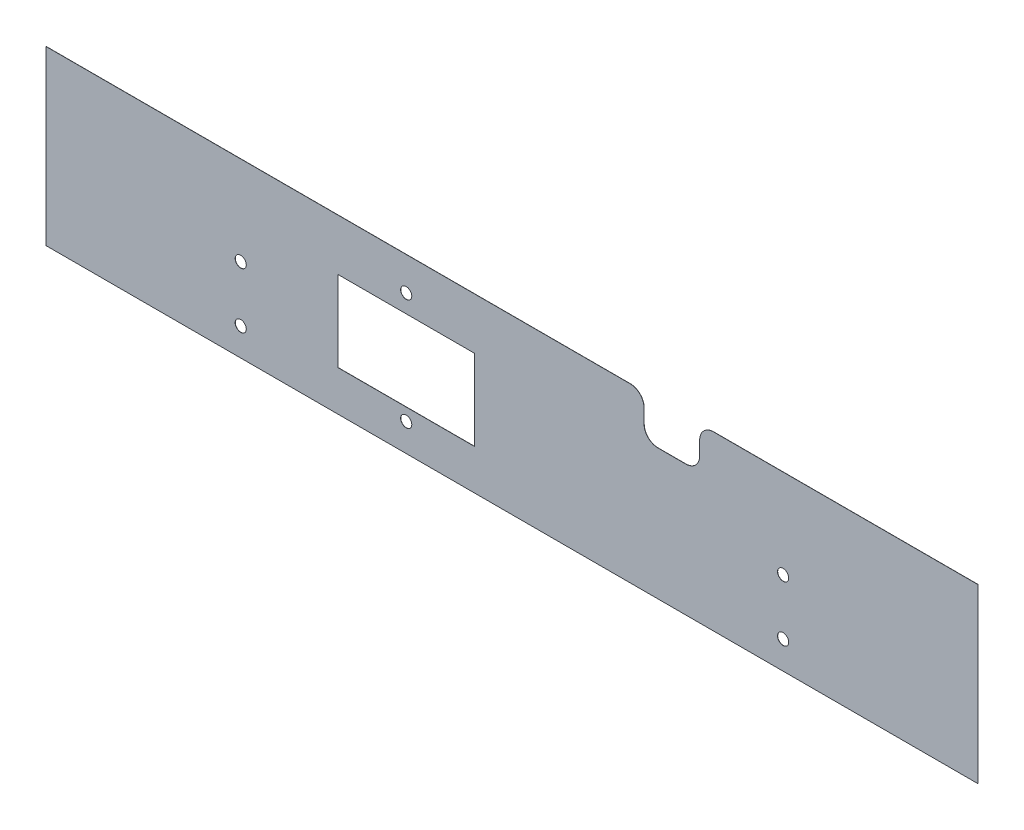
ISO-10303-21;
HEADER;
FILE_DESCRIPTION(('STEP AP214'),'2;1');
FILE_NAME('part.step','',(''),(''),'','','');
FILE_SCHEMA(('AUTOMOTIVE_DESIGN { 1 0 10303 214 1 1 1 1 }'));
ENDSEC;
DATA;
#1=APPLICATION_CONTEXT('core data for automotive mechanical design processes');
#2=APPLICATION_PROTOCOL_DEFINITION('international standard','automotive_design',2000,#1);
#3=PRODUCT_CONTEXT('',#1,'mechanical');
#4=PRODUCT('Part','Part','',(#3));
#5=PRODUCT_RELATED_PRODUCT_CATEGORY('part','',(#4));
#6=PRODUCT_DEFINITION_FORMATION('','',#4);
#7=PRODUCT_DEFINITION_CONTEXT('part definition',#1,'design');
#8=PRODUCT_DEFINITION('design','',#6,#7);
#9=PRODUCT_DEFINITION_SHAPE('','',#8);
#10=(LENGTH_UNIT() NAMED_UNIT(*) SI_UNIT(.MILLI.,.METRE.));
#11=(NAMED_UNIT(*) PLANE_ANGLE_UNIT() SI_UNIT($,.RADIAN.));
#12=(NAMED_UNIT(*) SI_UNIT($,.STERADIAN.) SOLID_ANGLE_UNIT());
#13=UNCERTAINTY_MEASURE_WITH_UNIT(LENGTH_MEASURE(1.E-05),#10,'distance_accuracy_value','');
#14=(GEOMETRIC_REPRESENTATION_CONTEXT(3) GLOBAL_UNCERTAINTY_ASSIGNED_CONTEXT((#13)) GLOBAL_UNIT_ASSIGNED_CONTEXT((#10,
#11,#12)) REPRESENTATION_CONTEXT('',''));
#15=CARTESIAN_POINT('',(0.,0.,0.));
#16=DIRECTION('',(0.,0.,1.));
#17=DIRECTION('',(1.,0.,0.));
#18=AXIS2_PLACEMENT_3D('',#15,#16,#17);
#19=CARTESIAN_POINT('',(-167.5,31.,0.0625));
#20=DIRECTION('',(0.,-1.,0.));
#21=DIRECTION('',(0.,0.,-1.));
#22=AXIS2_PLACEMENT_3D('',#19,#20,#21);
#23=PLANE('',#22);
#24=DIRECTION('',(-1.,0.,0.));
#25=VECTOR('',#24,1.);
#26=CARTESIAN_POINT('',(-167.5,31.,0.0625));
#27=LINE('',#26,#25);
#28=CARTESIAN_POINT('',(42.5,31.,0.0625));
#29=VERTEX_POINT('',#28);
#30=CARTESIAN_POINT('',(-167.5,31.,0.0625));
#31=VERTEX_POINT('',#30);
#32=EDGE_CURVE('E234',#29,#31,#27,.T.);
#33=ORIENTED_EDGE('',*,*,#32,.F.);
#34=DIRECTION('',(0.,0.,1.));
#35=VECTOR('',#34,1.);
#36=CARTESIAN_POINT('',(42.5,31.,0.0625));
#37=LINE('',#36,#35);
#38=CARTESIAN_POINT('',(42.5,31.,0.));
#39=VERTEX_POINT('',#38);
#40=EDGE_CURVE('E52',#29,#39,#37,.F.);
#41=ORIENTED_EDGE('',*,*,#40,.T.);
#42=DIRECTION('',(-1.,0.,0.));
#43=VECTOR('',#42,1.);
#44=CARTESIAN_POINT('',(-167.5,31.,0.));
#45=LINE('',#44,#43);
#46=CARTESIAN_POINT('',(-167.5,31.,0.));
#47=VERTEX_POINT('',#46);
#48=EDGE_CURVE('E250',#39,#47,#45,.T.);
#49=ORIENTED_EDGE('',*,*,#48,.T.);
#50=DIRECTION('',(0.,0.,-1.));
#51=VECTOR('',#50,1.);
#52=CARTESIAN_POINT('',(-167.5,31.,0.0625));
#53=LINE('',#52,#51);
#54=EDGE_CURVE('E263',#31,#47,#53,.T.);
#55=ORIENTED_EDGE('',*,*,#54,.F.);
#56=EDGE_LOOP('',(#33,#41,#49,#55));
#57=FACE_BOUND('',#56,.T.);
#58=ADVANCED_FACE('F37',(#57),#23,.F.);
#59=CARTESIAN_POINT('',(167.5,-31.,0.0625));
#60=DIRECTION('',(-1.,0.,0.));
#61=DIRECTION('',(0.,0.,1.));
#62=AXIS2_PLACEMENT_3D('',#59,#60,#61);
#63=PLANE('',#62);
#64=DIRECTION('',(0.,1.,0.));
#65=VECTOR('',#64,1.);
#66=CARTESIAN_POINT('',(167.5,-31.,0.));
#67=LINE('',#66,#65);
#68=CARTESIAN_POINT('',(167.5,-31.,0.));
#69=VERTEX_POINT('',#68);
#70=CARTESIAN_POINT('',(167.5,31.,0.));
#71=VERTEX_POINT('',#70);
#72=EDGE_CURVE('E215',#69,#71,#67,.T.);
#73=ORIENTED_EDGE('',*,*,#72,.T.);
#74=DIRECTION('',(0.,0.,-1.));
#75=VECTOR('',#74,1.);
#76=CARTESIAN_POINT('',(167.5,31.,0.0625));
#77=LINE('',#76,#75);
#78=CARTESIAN_POINT('',(167.5,31.,0.0625));
#79=VERTEX_POINT('',#78);
#80=EDGE_CURVE('E266',#79,#71,#77,.T.);
#81=ORIENTED_EDGE('',*,*,#80,.F.);
#82=DIRECTION('',(0.,1.,0.));
#83=VECTOR('',#82,1.);
#84=CARTESIAN_POINT('',(167.5,-31.,0.0625));
#85=LINE('',#84,#83);
#86=CARTESIAN_POINT('',(167.5,-31.,0.0625));
#87=VERTEX_POINT('',#86);
#88=EDGE_CURVE('E220',#87,#79,#85,.T.);
#89=ORIENTED_EDGE('',*,*,#88,.F.);
#90=DIRECTION('',(0.,0.,-1.));
#91=VECTOR('',#90,1.);
#92=CARTESIAN_POINT('',(167.5,-31.,0.0625));
#93=LINE('',#92,#91);
#94=EDGE_CURVE('E247',#87,#69,#93,.T.);
#95=ORIENTED_EDGE('',*,*,#94,.T.);
#96=EDGE_LOOP('',(#73,#81,#89,#95));
#97=FACE_BOUND('',#96,.T.);
#98=ADVANCED_FACE('F421',(#97),#63,.F.);
#99=CARTESIAN_POINT('',(72.5,31.,0.));
#100=VERTEX_POINT('',#99);
#101=EDGE_CURVE('E251',#71,#100,#45,.T.);
#102=ORIENTED_EDGE('',*,*,#101,.T.);
#103=DIRECTION('',(0.,0.,1.));
#104=VECTOR('',#103,1.);
#105=CARTESIAN_POINT('',(72.5,31.,0.0625));
#106=LINE('',#105,#104);
#107=CARTESIAN_POINT('',(72.5,31.,0.0625));
#108=VERTEX_POINT('',#107);
#109=EDGE_CURVE('E284',#100,#108,#106,.T.);
#110=ORIENTED_EDGE('',*,*,#109,.T.);
#111=EDGE_CURVE('E228',#79,#108,#27,.T.);
#112=ORIENTED_EDGE('',*,*,#111,.F.);
#113=ORIENTED_EDGE('',*,*,#80,.T.);
#114=EDGE_LOOP('',(#102,#110,#112,#113));
#115=FACE_BOUND('',#114,.T.);
#116=ADVANCED_FACE('F382',(#115),#23,.F.);
#117=CARTESIAN_POINT('',(-167.5,-31.,0.0625));
#118=DIRECTION('',(1.,0.,0.));
#119=DIRECTION('',(0.,0.,-1.));
#120=AXIS2_PLACEMENT_3D('',#117,#118,#119);
#121=PLANE('',#120);
#122=DIRECTION('',(0.,-1.,0.));
#123=VECTOR('',#122,1.);
#124=CARTESIAN_POINT('',(-167.5,-31.,0.));
#125=LINE('',#124,#123);
#126=CARTESIAN_POINT('',(-167.5,-31.,0.));
#127=VERTEX_POINT('',#126);
#128=EDGE_CURVE('E254',#47,#127,#125,.T.);
#129=ORIENTED_EDGE('',*,*,#128,.T.);
#130=DIRECTION('',(0.,0.,-1.));
#131=VECTOR('',#130,1.);
#132=CARTESIAN_POINT('',(-167.5,-31.,0.0625));
#133=LINE('',#132,#131);
#134=CARTESIAN_POINT('',(-167.5,-31.,0.0625));
#135=VERTEX_POINT('',#134);
#136=EDGE_CURVE('E260',#135,#127,#133,.T.);
#137=ORIENTED_EDGE('',*,*,#136,.F.);
#138=DIRECTION('',(0.,-1.,0.));
#139=VECTOR('',#138,1.);
#140=CARTESIAN_POINT('',(-167.5,-31.,0.0625));
#141=LINE('',#140,#139);
#142=EDGE_CURVE('E233',#31,#135,#141,.T.);
#143=ORIENTED_EDGE('',*,*,#142,.F.);
#144=ORIENTED_EDGE('',*,*,#54,.T.);
#145=EDGE_LOOP('',(#129,#137,#143,#144));
#146=FACE_BOUND('',#145,.T.);
#147=ADVANCED_FACE('F431',(#146),#121,.F.);
#148=CARTESIAN_POINT('',(-167.5,-31.,0.0625));
#149=DIRECTION('',(0.,1.,0.));
#150=DIRECTION('',(0.,0.,1.));
#151=AXIS2_PLACEMENT_3D('',#148,#149,#150);
#152=PLANE('',#151);
#153=DIRECTION('',(1.,0.,0.));
#154=VECTOR('',#153,1.);
#155=CARTESIAN_POINT('',(-167.5,-31.,0.));
#156=LINE('',#155,#154);
#157=EDGE_CURVE('E256',#127,#69,#156,.T.);
#158=ORIENTED_EDGE('',*,*,#157,.T.);
#159=ORIENTED_EDGE('',*,*,#94,.F.);
#160=DIRECTION('',(1.,0.,0.));
#161=VECTOR('',#160,1.);
#162=CARTESIAN_POINT('',(-167.5,-31.,0.0625));
#163=LINE('',#162,#161);
#164=EDGE_CURVE('E243',#135,#87,#163,.T.);
#165=ORIENTED_EDGE('',*,*,#164,.F.);
#166=ORIENTED_EDGE('',*,*,#136,.T.);
#167=EDGE_LOOP('',(#158,#159,#165,#166));
#168=FACE_BOUND('',#167,.T.);
#169=ADVANCED_FACE('F372',(#168),#152,.F.);
#170=CARTESIAN_POINT('',(0.,0.,0.0625));
#171=DIRECTION('',(0.,0.,-1.));
#172=DIRECTION('',(-1.,0.,0.));
#173=AXIS2_PLACEMENT_3D('',#170,#171,#172);
#174=PLANE('',#173);
#175=CARTESIAN_POINT('',(-38.,-21.,0.0625));
#176=DIRECTION('',(0.,0.,1.));
#177=DIRECTION('',(1.,0.,0.));
#178=AXIS2_PLACEMENT_3D('',#175,#176,#177);
#179=CIRCLE('',#178,2.);
#180=CARTESIAN_POINT('',(-36.,-21.,0.0625));
#181=VERTEX_POINT('',#180);
#182=EDGE_CURVE('E344',#181,#181,#179,.T.);
#183=ORIENTED_EDGE('',*,*,#182,.F.);
#184=EDGE_LOOP('',(#183));
#185=FACE_BOUND('',#184,.T.);
#186=CARTESIAN_POINT('',(-38.,19.,0.0625));
#187=DIRECTION('',(0.,0.,1.));
#188=DIRECTION('',(1.,0.,0.));
#189=AXIS2_PLACEMENT_3D('',#186,#187,#188);
#190=CIRCLE('',#189,2.);
#191=CARTESIAN_POINT('',(-36.,19.,0.0625));
#192=VERTEX_POINT('',#191);
#193=EDGE_CURVE('E339',#192,#192,#190,.T.);
#194=ORIENTED_EDGE('',*,*,#193,.F.);
#195=EDGE_LOOP('',(#194));
#196=FACE_BOUND('',#195,.T.);
#197=DIRECTION('',(1.,0.,0.));
#198=VECTOR('',#197,1.);
#199=CARTESIAN_POINT('',(-62.5,-16.5,0.0625));
#200=LINE('',#199,#198);
#201=CARTESIAN_POINT('',(-62.5,-16.5,0.0625));
#202=VERTEX_POINT('',#201);
#203=CARTESIAN_POINT('',(-13.5,-16.5,0.0625));
#204=VERTEX_POINT('',#203);
#205=EDGE_CURVE('E167',#202,#204,#200,.T.);
#206=ORIENTED_EDGE('',*,*,#205,.F.);
#207=DIRECTION('',(0.,-1.,0.));
#208=VECTOR('',#207,1.);
#209=CARTESIAN_POINT('',(-62.5,-16.5,0.0625));
#210=LINE('',#209,#208);
#211=CARTESIAN_POINT('',(-62.5,12.5,0.0625));
#212=VERTEX_POINT('',#211);
#213=EDGE_CURVE('E173',#212,#202,#210,.T.);
#214=ORIENTED_EDGE('',*,*,#213,.F.);
#215=DIRECTION('',(-1.,0.,0.));
#216=VECTOR('',#215,1.);
#217=CARTESIAN_POINT('',(-62.5,12.5,0.0625));
#218=LINE('',#217,#216);
#219=CARTESIAN_POINT('',(-13.5,12.5,0.0625));
#220=VERTEX_POINT('',#219);
#221=EDGE_CURVE('E178',#220,#212,#218,.T.);
#222=ORIENTED_EDGE('',*,*,#221,.F.);
#223=DIRECTION('',(0.,1.,0.));
#224=VECTOR('',#223,1.);
#225=CARTESIAN_POINT('',(-13.5,-16.5,0.0625));
#226=LINE('',#225,#224);
#227=EDGE_CURVE('E156',#204,#220,#226,.T.);
#228=ORIENTED_EDGE('',*,*,#227,.F.);
#229=EDGE_LOOP('',(#206,#214,#222,#228));
#230=FACE_BOUND('',#229,.T.);
#231=CARTESIAN_POINT('',(-97.5,-21.,0.0625));
#232=DIRECTION('',(0.,0.,1.));
#233=DIRECTION('',(1.,0.,0.));
#234=AXIS2_PLACEMENT_3D('',#231,#232,#233);
#235=CIRCLE('',#234,2.);
#236=CARTESIAN_POINT('',(-95.5,-21.,0.0625));
#237=VERTEX_POINT('',#236);
#238=EDGE_CURVE('E197',#237,#237,#235,.T.);
#239=ORIENTED_EDGE('',*,*,#238,.F.);
#240=EDGE_LOOP('',(#239));
#241=FACE_BOUND('',#240,.T.);
#242=CARTESIAN_POINT('',(97.5,-1.,0.0625));
#243=DIRECTION('',(0.,0.,1.));
#244=DIRECTION('',(1.,0.,0.));
#245=AXIS2_PLACEMENT_3D('',#242,#243,#244);
#246=CIRCLE('',#245,2.);
#247=CARTESIAN_POINT('',(99.5,-1.,0.0625));
#248=VERTEX_POINT('',#247);
#249=EDGE_CURVE('E206',#248,#248,#246,.T.);
#250=ORIENTED_EDGE('',*,*,#249,.F.);
#251=EDGE_LOOP('',(#250));
#252=FACE_BOUND('',#251,.T.);
#253=CARTESIAN_POINT('',(97.5,-21.,0.0625));
#254=DIRECTION('',(0.,0.,1.));
#255=DIRECTION('',(1.,0.,0.));
#256=AXIS2_PLACEMENT_3D('',#253,#254,#255);
#257=CIRCLE('',#256,2.);
#258=CARTESIAN_POINT('',(99.5,-21.,0.0625));
#259=VERTEX_POINT('',#258);
#260=EDGE_CURVE('E292',#259,#259,#257,.T.);
#261=ORIENTED_EDGE('',*,*,#260,.F.);
#262=EDGE_LOOP('',(#261));
#263=FACE_BOUND('',#262,.T.);
#264=CARTESIAN_POINT('',(-97.5,-1.,0.0625));
#265=DIRECTION('',(0.,0.,1.));
#266=DIRECTION('',(1.,0.,0.));
#267=AXIS2_PLACEMENT_3D('',#264,#265,#266);
#268=CIRCLE('',#267,2.);
#269=CARTESIAN_POINT('',(-95.5,-1.,0.0625));
#270=VERTEX_POINT('',#269);
#271=EDGE_CURVE('E216',#270,#270,#268,.T.);
#272=ORIENTED_EDGE('',*,*,#271,.F.);
#273=EDGE_LOOP('',(#272));
#274=FACE_BOUND('',#273,.T.);
#275=ORIENTED_EDGE('',*,*,#111,.T.);
#276=CARTESIAN_POINT('',(72.5,26.,0.0625));
#277=DIRECTION('',(0.,0.,-1.));
#278=DIRECTION('',(-1.,0.,0.));
#279=AXIS2_PLACEMENT_3D('',#276,#277,#278);
#280=CIRCLE('',#279,5.);
#281=CARTESIAN_POINT('',(67.5,26.,0.0625));
#282=VERTEX_POINT('',#281);
#283=EDGE_CURVE('E298',#108,#282,#280,.F.);
#284=ORIENTED_EDGE('',*,*,#283,.T.);
#285=DIRECTION('',(0.,1.,0.));
#286=VECTOR('',#285,1.);
#287=CARTESIAN_POINT('',(67.5,16.,0.0625));
#288=LINE('',#287,#286);
#289=CARTESIAN_POINT('',(67.5,21.,0.0625));
#290=VERTEX_POINT('',#289);
#291=EDGE_CURVE('E332',#290,#282,#288,.T.);
#292=ORIENTED_EDGE('',*,*,#291,.F.);
#293=CARTESIAN_POINT('',(62.5,21.,0.0625000000000001));
#294=DIRECTION('',(0.,0.,-1.));
#295=DIRECTION('',(-1.,0.,0.));
#296=AXIS2_PLACEMENT_3D('',#293,#294,#295);
#297=CIRCLE('',#296,5.);
#298=CARTESIAN_POINT('',(62.5,16.,0.0625));
#299=VERTEX_POINT('',#298);
#300=EDGE_CURVE('E321',#290,#299,#297,.T.);
#301=ORIENTED_EDGE('',*,*,#300,.T.);
#302=DIRECTION('',(1.,0.,0.));
#303=VECTOR('',#302,1.);
#304=CARTESIAN_POINT('',(47.5,16.,0.0625));
#305=LINE('',#304,#303);
#306=CARTESIAN_POINT('',(52.5,16.,0.0625));
#307=VERTEX_POINT('',#306);
#308=EDGE_CURVE('E328',#307,#299,#305,.T.);
#309=ORIENTED_EDGE('',*,*,#308,.F.);
#310=CARTESIAN_POINT('',(52.5,21.,0.0625000000000001));
#311=DIRECTION('',(0.,0.,-1.));
#312=DIRECTION('',(-1.,0.,0.));
#313=AXIS2_PLACEMENT_3D('',#310,#311,#312);
#314=CIRCLE('',#313,5.);
#315=CARTESIAN_POINT('',(47.5,21.,0.0625));
#316=VERTEX_POINT('',#315);
#317=EDGE_CURVE('E45',#307,#316,#314,.T.);
#318=ORIENTED_EDGE('',*,*,#317,.T.);
#319=DIRECTION('',(0.,-1.,0.));
#320=VECTOR('',#319,1.);
#321=CARTESIAN_POINT('',(47.5,16.,0.0625));
#322=LINE('',#321,#320);
#323=CARTESIAN_POINT('',(47.5,26.,0.0625));
#324=VERTEX_POINT('',#323);
#325=EDGE_CURVE('E333',#324,#316,#322,.T.);
#326=ORIENTED_EDGE('',*,*,#325,.F.);
#327=CARTESIAN_POINT('',(42.5,26.,0.0625000000000001));
#328=DIRECTION('',(0.,0.,-1.));
#329=DIRECTION('',(-1.,0.,0.));
#330=AXIS2_PLACEMENT_3D('',#327,#328,#329);
#331=CIRCLE('',#330,5.);
#332=EDGE_CURVE('E295',#324,#29,#331,.F.);
#333=ORIENTED_EDGE('',*,*,#332,.T.);
#334=ORIENTED_EDGE('',*,*,#32,.T.);
#335=ORIENTED_EDGE('',*,*,#142,.T.);
#336=ORIENTED_EDGE('',*,*,#164,.T.);
#337=ORIENTED_EDGE('',*,*,#88,.T.);
#338=EDGE_LOOP('',(#275,#284,#292,#301,#309,#318,#326,#333,#334,#335,#336,#337));
#339=FACE_BOUND('',#338,.T.);
#340=ADVANCED_FACE('F175',(#185,#196,#230,#241,#252,#263,#274,#339),#174,.F.);
#341=CARTESIAN_POINT('',(0.,0.,0.));
#342=DIRECTION('',(0.,0.,-1.));
#343=DIRECTION('',(-1.,0.,0.));
#344=AXIS2_PLACEMENT_3D('',#341,#342,#343);
#345=PLANE('',#344);
#346=CARTESIAN_POINT('',(-38.,-21.,0.));
#347=DIRECTION('',(0.,0.,-1.));
#348=DIRECTION('',(-1.,0.,0.));
#349=AXIS2_PLACEMENT_3D('',#346,#347,#348);
#350=CIRCLE('',#349,2.);
#351=CARTESIAN_POINT('',(-40.,-21.,0.));
#352=VERTEX_POINT('',#351);
#353=EDGE_CURVE('E288',#352,#352,#350,.T.);
#354=ORIENTED_EDGE('',*,*,#353,.F.);
#355=EDGE_LOOP('',(#354));
#356=FACE_BOUND('',#355,.T.);
#357=CARTESIAN_POINT('',(-38.,19.,0.));
#358=DIRECTION('',(0.,0.,-1.));
#359=DIRECTION('',(-1.,0.,0.));
#360=AXIS2_PLACEMENT_3D('',#357,#358,#359);
#361=CIRCLE('',#360,2.);
#362=CARTESIAN_POINT('',(-40.,19.,0.));
#363=VERTEX_POINT('',#362);
#364=EDGE_CURVE('E285',#363,#363,#361,.T.);
#365=ORIENTED_EDGE('',*,*,#364,.F.);
#366=EDGE_LOOP('',(#365));
#367=FACE_BOUND('',#366,.T.);
#368=DIRECTION('',(0.,-1.,0.));
#369=VECTOR('',#368,1.);
#370=CARTESIAN_POINT('',(67.5,0.,0.));
#371=LINE('',#370,#369);
#372=CARTESIAN_POINT('',(67.5,26.,0.));
#373=VERTEX_POINT('',#372);
#374=CARTESIAN_POINT('',(67.5,21.,0.));
#375=VERTEX_POINT('',#374);
#376=EDGE_CURVE('E278',#373,#375,#371,.T.);
#377=ORIENTED_EDGE('',*,*,#376,.F.);
#378=CARTESIAN_POINT('',(72.5,26.,0.));
#379=DIRECTION('',(0.,0.,-1.));
#380=DIRECTION('',(-1.,0.,0.));
#381=AXIS2_PLACEMENT_3D('',#378,#379,#380);
#382=CIRCLE('',#381,5.);
#383=EDGE_CURVE('E308',#373,#100,#382,.T.);
#384=ORIENTED_EDGE('',*,*,#383,.T.);
#385=ORIENTED_EDGE('',*,*,#101,.F.);
#386=ORIENTED_EDGE('',*,*,#72,.F.);
#387=ORIENTED_EDGE('',*,*,#157,.F.);
#388=ORIENTED_EDGE('',*,*,#128,.F.);
#389=ORIENTED_EDGE('',*,*,#48,.F.);
#390=CARTESIAN_POINT('',(42.5,26.,0.));
#391=DIRECTION('',(0.,0.,-1.));
#392=DIRECTION('',(-1.,0.,0.));
#393=AXIS2_PLACEMENT_3D('',#390,#391,#392);
#394=CIRCLE('',#393,5.);
#395=CARTESIAN_POINT('',(47.5,26.,0.));
#396=VERTEX_POINT('',#395);
#397=EDGE_CURVE('E306',#39,#396,#394,.T.);
#398=ORIENTED_EDGE('',*,*,#397,.T.);
#399=DIRECTION('',(0.,1.,0.));
#400=VECTOR('',#399,1.);
#401=CARTESIAN_POINT('',(47.5,0.,0.));
#402=LINE('',#401,#400);
#403=CARTESIAN_POINT('',(47.5,21.,0.));
#404=VERTEX_POINT('',#403);
#405=EDGE_CURVE('E281',#404,#396,#402,.T.);
#406=ORIENTED_EDGE('',*,*,#405,.F.);
#407=CARTESIAN_POINT('',(52.5,21.,0.));
#408=DIRECTION('',(0.,0.,-1.));
#409=DIRECTION('',(-1.,0.,0.));
#410=AXIS2_PLACEMENT_3D('',#407,#408,#409);
#411=CIRCLE('',#410,5.);
#412=CARTESIAN_POINT('',(52.5,16.,0.));
#413=VERTEX_POINT('',#412);
#414=EDGE_CURVE('E12',#404,#413,#411,.F.);
#415=ORIENTED_EDGE('',*,*,#414,.T.);
#416=DIRECTION('',(-1.,0.,0.));
#417=VECTOR('',#416,1.);
#418=CARTESIAN_POINT('',(0.,16.,0.));
#419=LINE('',#418,#417);
#420=CARTESIAN_POINT('',(62.5,16.,0.));
#421=VERTEX_POINT('',#420);
#422=EDGE_CURVE('E276',#421,#413,#419,.T.);
#423=ORIENTED_EDGE('',*,*,#422,.F.);
#424=CARTESIAN_POINT('',(62.5,21.,0.));
#425=DIRECTION('',(0.,0.,-1.));
#426=DIRECTION('',(-1.,0.,0.));
#427=AXIS2_PLACEMENT_3D('',#424,#425,#426);
#428=CIRCLE('',#427,5.);
#429=EDGE_CURVE('E325',#421,#375,#428,.F.);
#430=ORIENTED_EDGE('',*,*,#429,.T.);
#431=EDGE_LOOP('',(#377,#384,#385,#386,#387,#388,#389,#398,#406,#415,#423,#430));
#432=FACE_BOUND('',#431,.T.);
#433=DIRECTION('',(0.,1.,0.));
#434=VECTOR('',#433,1.);
#435=CARTESIAN_POINT('',(-62.5,0.,0.));
#436=LINE('',#435,#434);
#437=CARTESIAN_POINT('',(-62.5,-16.5,0.));
#438=VERTEX_POINT('',#437);
#439=CARTESIAN_POINT('',(-62.5,12.5,0.));
#440=VERTEX_POINT('',#439);
#441=EDGE_CURVE('E274',#438,#440,#436,.T.);
#442=ORIENTED_EDGE('',*,*,#441,.F.);
#443=DIRECTION('',(-1.,0.,0.));
#444=VECTOR('',#443,1.);
#445=CARTESIAN_POINT('',(0.,-16.5,0.));
#446=LINE('',#445,#444);
#447=CARTESIAN_POINT('',(-13.5,-16.5,0.));
#448=VERTEX_POINT('',#447);
#449=EDGE_CURVE('E269',#448,#438,#446,.T.);
#450=ORIENTED_EDGE('',*,*,#449,.F.);
#451=DIRECTION('',(0.,-1.,0.));
#452=VECTOR('',#451,1.);
#453=CARTESIAN_POINT('',(-13.5,0.,0.));
#454=LINE('',#453,#452);
#455=CARTESIAN_POINT('',(-13.5,12.5,0.));
#456=VERTEX_POINT('',#455);
#457=EDGE_CURVE('E159',#456,#448,#454,.T.);
#458=ORIENTED_EDGE('',*,*,#457,.F.);
#459=DIRECTION('',(1.,0.,0.));
#460=VECTOR('',#459,1.);
#461=CARTESIAN_POINT('',(0.,12.5,0.));
#462=LINE('',#461,#460);
#463=EDGE_CURVE('E272',#440,#456,#462,.T.);
#464=ORIENTED_EDGE('',*,*,#463,.F.);
#465=EDGE_LOOP('',(#442,#450,#458,#464));
#466=FACE_BOUND('',#465,.T.);
#467=CARTESIAN_POINT('',(-97.5,-21.,0.));
#468=DIRECTION('',(0.,0.,1.));
#469=DIRECTION('',(1.,0.,0.));
#470=AXIS2_PLACEMENT_3D('',#467,#468,#469);
#471=CIRCLE('',#470,2.);
#472=CARTESIAN_POINT('',(-95.5,-21.,0.));
#473=VERTEX_POINT('',#472);
#474=EDGE_CURVE('E202',#473,#473,#471,.T.);
#475=ORIENTED_EDGE('',*,*,#474,.T.);
#476=EDGE_LOOP('',(#475));
#477=FACE_BOUND('',#476,.T.);
#478=CARTESIAN_POINT('',(97.5,-1.,0.));
#479=DIRECTION('',(0.,0.,1.));
#480=DIRECTION('',(1.,0.,0.));
#481=AXIS2_PLACEMENT_3D('',#478,#479,#480);
#482=CIRCLE('',#481,2.);
#483=CARTESIAN_POINT('',(99.5,-1.,0.));
#484=VERTEX_POINT('',#483);
#485=EDGE_CURVE('E203',#484,#484,#482,.T.);
#486=ORIENTED_EDGE('',*,*,#485,.T.);
#487=EDGE_LOOP('',(#486));
#488=FACE_BOUND('',#487,.T.);
#489=CARTESIAN_POINT('',(97.5,-21.,0.));
#490=DIRECTION('',(0.,0.,1.));
#491=DIRECTION('',(1.,0.,0.));
#492=AXIS2_PLACEMENT_3D('',#489,#490,#491);
#493=CIRCLE('',#492,2.);
#494=CARTESIAN_POINT('',(99.5,-21.,0.));
#495=VERTEX_POINT('',#494);
#496=EDGE_CURVE('E211',#495,#495,#493,.T.);
#497=ORIENTED_EDGE('',*,*,#496,.T.);
#498=EDGE_LOOP('',(#497));
#499=FACE_BOUND('',#498,.T.);
#500=CARTESIAN_POINT('',(-97.5,-1.,0.));
#501=DIRECTION('',(0.,0.,1.));
#502=DIRECTION('',(1.,0.,0.));
#503=AXIS2_PLACEMENT_3D('',#500,#501,#502);
#504=CIRCLE('',#503,2.);
#505=CARTESIAN_POINT('',(-95.5,-1.,0.));
#506=VERTEX_POINT('',#505);
#507=EDGE_CURVE('E212',#506,#506,#504,.T.);
#508=ORIENTED_EDGE('',*,*,#507,.T.);
#509=EDGE_LOOP('',(#508));
#510=FACE_BOUND('',#509,.T.);
#511=ADVANCED_FACE('F371',(#356,#367,#432,#466,#477,#488,#499,#510),#345,.T.);
#512=CARTESIAN_POINT('',(-97.5,-1.,0.));
#513=DIRECTION('',(0.,0.,1.));
#514=DIRECTION('',(1.,0.,0.));
#515=AXIS2_PLACEMENT_3D('',#512,#513,#514);
#516=CYLINDRICAL_SURFACE('',#515,2.);
#517=ORIENTED_EDGE('',*,*,#507,.F.);
#518=EDGE_LOOP('',(#517));
#519=FACE_BOUND('',#518,.T.);
#520=ORIENTED_EDGE('',*,*,#271,.T.);
#521=EDGE_LOOP('',(#520));
#522=FACE_BOUND('',#521,.T.);
#523=ADVANCED_FACE('F443',(#519,#522),#516,.F.);
#524=CARTESIAN_POINT('',(97.5,-21.,0.));
#525=DIRECTION('',(0.,0.,1.));
#526=DIRECTION('',(1.,0.,0.));
#527=AXIS2_PLACEMENT_3D('',#524,#525,#526);
#528=CYLINDRICAL_SURFACE('',#527,2.);
#529=ORIENTED_EDGE('',*,*,#496,.F.);
#530=EDGE_LOOP('',(#529));
#531=FACE_BOUND('',#530,.T.);
#532=ORIENTED_EDGE('',*,*,#260,.T.);
#533=EDGE_LOOP('',(#532));
#534=FACE_BOUND('',#533,.T.);
#535=ADVANCED_FACE('F367',(#531,#534),#528,.F.);
#536=CARTESIAN_POINT('',(97.5,-1.,0.));
#537=DIRECTION('',(0.,0.,1.));
#538=DIRECTION('',(1.,0.,0.));
#539=AXIS2_PLACEMENT_3D('',#536,#537,#538);
#540=CYLINDRICAL_SURFACE('',#539,2.);
#541=ORIENTED_EDGE('',*,*,#485,.F.);
#542=EDGE_LOOP('',(#541));
#543=FACE_BOUND('',#542,.T.);
#544=ORIENTED_EDGE('',*,*,#249,.T.);
#545=EDGE_LOOP('',(#544));
#546=FACE_BOUND('',#545,.T.);
#547=ADVANCED_FACE('F449',(#543,#546),#540,.F.);
#548=CARTESIAN_POINT('',(-97.5,-21.,0.));
#549=DIRECTION('',(0.,0.,1.));
#550=DIRECTION('',(1.,0.,0.));
#551=AXIS2_PLACEMENT_3D('',#548,#549,#550);
#552=CYLINDRICAL_SURFACE('',#551,2.);
#553=ORIENTED_EDGE('',*,*,#474,.F.);
#554=EDGE_LOOP('',(#553));
#555=FACE_BOUND('',#554,.T.);
#556=ORIENTED_EDGE('',*,*,#238,.T.);
#557=EDGE_LOOP('',(#556));
#558=FACE_BOUND('',#557,.T.);
#559=ADVANCED_FACE('F452',(#555,#558),#552,.F.);
#560=CARTESIAN_POINT('',(-62.5,-16.5,-9.9375));
#561=DIRECTION('',(-1.,0.,0.));
#562=DIRECTION('',(0.,0.,1.));
#563=AXIS2_PLACEMENT_3D('',#560,#561,#562);
#564=PLANE('',#563);
#565=ORIENTED_EDGE('',*,*,#441,.T.);
#566=DIRECTION('',(0.,0.,1.));
#567=VECTOR('',#566,1.);
#568=CARTESIAN_POINT('',(-62.5,12.5,-9.9375));
#569=LINE('',#568,#567);
#570=EDGE_CURVE('E289',#440,#212,#569,.T.);
#571=ORIENTED_EDGE('',*,*,#570,.T.);
#572=ORIENTED_EDGE('',*,*,#213,.T.);
#573=DIRECTION('',(0.,0.,1.));
#574=VECTOR('',#573,1.);
#575=CARTESIAN_POINT('',(-62.5,-16.5,-9.9375));
#576=LINE('',#575,#574);
#577=EDGE_CURVE('E163',#438,#202,#576,.T.);
#578=ORIENTED_EDGE('',*,*,#577,.F.);
#579=EDGE_LOOP('',(#565,#571,#572,#578));
#580=FACE_BOUND('',#579,.T.);
#581=ADVANCED_FACE('F352',(#580),#564,.F.);
#582=CARTESIAN_POINT('',(-62.5,12.5,-9.9375));
#583=DIRECTION('',(0.,1.,0.));
#584=DIRECTION('',(0.,0.,1.));
#585=AXIS2_PLACEMENT_3D('',#582,#583,#584);
#586=PLANE('',#585);
#587=ORIENTED_EDGE('',*,*,#463,.T.);
#588=DIRECTION('',(0.,0.,1.));
#589=VECTOR('',#588,1.);
#590=CARTESIAN_POINT('',(-13.5,12.5,-9.9375));
#591=LINE('',#590,#589);
#592=EDGE_CURVE('E162',#456,#220,#591,.T.);
#593=ORIENTED_EDGE('',*,*,#592,.T.);
#594=ORIENTED_EDGE('',*,*,#221,.T.);
#595=ORIENTED_EDGE('',*,*,#570,.F.);
#596=EDGE_LOOP('',(#587,#593,#594,#595));
#597=FACE_BOUND('',#596,.T.);
#598=ADVANCED_FACE('F357',(#597),#586,.F.);
#599=CARTESIAN_POINT('',(-13.5,-16.5,-9.9375));
#600=DIRECTION('',(1.,0.,0.));
#601=DIRECTION('',(0.,0.,-1.));
#602=AXIS2_PLACEMENT_3D('',#599,#600,#601);
#603=PLANE('',#602);
#604=ORIENTED_EDGE('',*,*,#457,.T.);
#605=DIRECTION('',(0.,0.,1.));
#606=VECTOR('',#605,1.);
#607=CARTESIAN_POINT('',(-13.5,-16.5,-9.9375));
#608=LINE('',#607,#606);
#609=EDGE_CURVE('E151',#448,#204,#608,.T.);
#610=ORIENTED_EDGE('',*,*,#609,.T.);
#611=ORIENTED_EDGE('',*,*,#227,.T.);
#612=ORIENTED_EDGE('',*,*,#592,.F.);
#613=EDGE_LOOP('',(#604,#610,#611,#612));
#614=FACE_BOUND('',#613,.T.);
#615=ADVANCED_FACE('F153',(#614),#603,.F.);
#616=CARTESIAN_POINT('',(-62.5,-16.5,-9.9375));
#617=DIRECTION('',(0.,-1.,0.));
#618=DIRECTION('',(0.,0.,-1.));
#619=AXIS2_PLACEMENT_3D('',#616,#617,#618);
#620=PLANE('',#619);
#621=ORIENTED_EDGE('',*,*,#449,.T.);
#622=ORIENTED_EDGE('',*,*,#577,.T.);
#623=ORIENTED_EDGE('',*,*,#205,.T.);
#624=ORIENTED_EDGE('',*,*,#609,.F.);
#625=EDGE_LOOP('',(#621,#622,#623,#624));
#626=FACE_BOUND('',#625,.T.);
#627=ADVANCED_FACE('F168',(#626),#620,.F.);
#628=CARTESIAN_POINT('',(47.5,16.,-9.9375));
#629=DIRECTION('',(-1.,0.,0.));
#630=DIRECTION('',(0.,0.,1.));
#631=AXIS2_PLACEMENT_3D('',#628,#629,#630);
#632=PLANE('',#631);
#633=ORIENTED_EDGE('',*,*,#325,.T.);
#634=DIRECTION('',(0.,0.,1.));
#635=VECTOR('',#634,1.);
#636=CARTESIAN_POINT('',(47.5,21.,0.));
#637=LINE('',#636,#635);
#638=EDGE_CURVE('E318',#316,#404,#637,.F.);
#639=ORIENTED_EDGE('',*,*,#638,.T.);
#640=ORIENTED_EDGE('',*,*,#405,.T.);
#641=DIRECTION('',(0.,0.,1.));
#642=VECTOR('',#641,1.);
#643=CARTESIAN_POINT('',(47.5,26.,-9.9375));
#644=LINE('',#643,#642);
#645=EDGE_CURVE('E315',#396,#324,#644,.T.);
#646=ORIENTED_EDGE('',*,*,#645,.T.);
#647=EDGE_LOOP('',(#633,#639,#640,#646));
#648=FACE_BOUND('',#647,.T.);
#649=ADVANCED_FACE('F406',(#648),#632,.F.);
#650=CARTESIAN_POINT('',(67.5,16.,-9.9375));
#651=DIRECTION('',(1.,0.,0.));
#652=DIRECTION('',(0.,0.,-1.));
#653=AXIS2_PLACEMENT_3D('',#650,#651,#652);
#654=PLANE('',#653);
#655=ORIENTED_EDGE('',*,*,#291,.T.);
#656=DIRECTION('',(0.,0.,1.));
#657=VECTOR('',#656,1.);
#658=CARTESIAN_POINT('',(67.5,26.,-9.9375));
#659=LINE('',#658,#657);
#660=EDGE_CURVE('E304',#282,#373,#659,.F.);
#661=ORIENTED_EDGE('',*,*,#660,.T.);
#662=ORIENTED_EDGE('',*,*,#376,.T.);
#663=DIRECTION('',(0.,0.,1.));
#664=VECTOR('',#663,1.);
#665=CARTESIAN_POINT('',(67.5,21.,0.0625000000000001));
#666=LINE('',#665,#664);
#667=EDGE_CURVE('E301',#375,#290,#666,.T.);
#668=ORIENTED_EDGE('',*,*,#667,.T.);
#669=EDGE_LOOP('',(#655,#661,#662,#668));
#670=FACE_BOUND('',#669,.T.);
#671=ADVANCED_FACE('F390',(#670),#654,.F.);
#672=CARTESIAN_POINT('',(47.5,16.,-9.9375));
#673=DIRECTION('',(0.,-1.,0.));
#674=DIRECTION('',(0.,0.,-1.));
#675=AXIS2_PLACEMENT_3D('',#672,#673,#674);
#676=PLANE('',#675);
#677=ORIENTED_EDGE('',*,*,#308,.T.);
#678=DIRECTION('',(0.,0.,1.));
#679=VECTOR('',#678,1.);
#680=CARTESIAN_POINT('',(62.5,16.,0.));
#681=LINE('',#680,#679);
#682=EDGE_CURVE('E313',#299,#421,#681,.F.);
#683=ORIENTED_EDGE('',*,*,#682,.T.);
#684=ORIENTED_EDGE('',*,*,#422,.T.);
#685=DIRECTION('',(0.,0.,1.));
#686=VECTOR('',#685,1.);
#687=CARTESIAN_POINT('',(52.5,16.,0.0625000000000001));
#688=LINE('',#687,#686);
#689=EDGE_CURVE('E310',#413,#307,#688,.T.);
#690=ORIENTED_EDGE('',*,*,#689,.T.);
#691=EDGE_LOOP('',(#677,#683,#684,#690));
#692=FACE_BOUND('',#691,.T.);
#693=ADVANCED_FACE('F410',(#692),#676,.F.);
#694=CARTESIAN_POINT('',(-38.,19.,-9.9375));
#695=DIRECTION('',(0.,0.,1.));
#696=DIRECTION('',(1.,0.,0.));
#697=AXIS2_PLACEMENT_3D('',#694,#695,#696);
#698=CYLINDRICAL_SURFACE('',#697,2.);
#699=ORIENTED_EDGE('',*,*,#364,.T.);
#700=EDGE_LOOP('',(#699));
#701=FACE_BOUND('',#700,.T.);
#702=ORIENTED_EDGE('',*,*,#193,.T.);
#703=EDGE_LOOP('',(#702));
#704=FACE_BOUND('',#703,.T.);
#705=ADVANCED_FACE('F470',(#701,#704),#698,.F.);
#706=CARTESIAN_POINT('',(-38.,-21.,-9.9375));
#707=DIRECTION('',(0.,0.,1.));
#708=DIRECTION('',(1.,0.,0.));
#709=AXIS2_PLACEMENT_3D('',#706,#707,#708);
#710=CYLINDRICAL_SURFACE('',#709,2.);
#711=ORIENTED_EDGE('',*,*,#353,.T.);
#712=EDGE_LOOP('',(#711));
#713=FACE_BOUND('',#712,.T.);
#714=ORIENTED_EDGE('',*,*,#182,.T.);
#715=EDGE_LOOP('',(#714));
#716=FACE_BOUND('',#715,.T.);
#717=ADVANCED_FACE('F418',(#713,#716),#710,.F.);
#718=CARTESIAN_POINT('',(72.5,26.,0.0625));
#719=DIRECTION('',(0.,0.,1.));
#720=DIRECTION('',(1.,0.,0.));
#721=AXIS2_PLACEMENT_3D('',#718,#719,#720);
#722=CYLINDRICAL_SURFACE('',#721,5.);
#723=ORIENTED_EDGE('',*,*,#383,.F.);
#724=ORIENTED_EDGE('',*,*,#660,.F.);
#725=ORIENTED_EDGE('',*,*,#283,.F.);
#726=ORIENTED_EDGE('',*,*,#109,.F.);
#727=EDGE_LOOP('',(#723,#724,#725,#726));
#728=FACE_BOUND('',#727,.T.);
#729=ADVANCED_FACE('F386',(#728),#722,.T.);
#730=CARTESIAN_POINT('',(62.5,21.,-9.9375));
#731=DIRECTION('',(0.,0.,-1.));
#732=DIRECTION('',(-1.,0.,0.));
#733=AXIS2_PLACEMENT_3D('',#730,#731,#732);
#734=CYLINDRICAL_SURFACE('',#733,5.);
#735=ORIENTED_EDGE('',*,*,#429,.F.);
#736=ORIENTED_EDGE('',*,*,#682,.F.);
#737=ORIENTED_EDGE('',*,*,#300,.F.);
#738=ORIENTED_EDGE('',*,*,#667,.F.);
#739=EDGE_LOOP('',(#735,#736,#737,#738));
#740=FACE_BOUND('',#739,.T.);
#741=ADVANCED_FACE('F411',(#740),#734,.F.);
#742=CARTESIAN_POINT('',(52.5,21.,-9.9375));
#743=DIRECTION('',(0.,0.,-1.));
#744=DIRECTION('',(-1.,0.,0.));
#745=AXIS2_PLACEMENT_3D('',#742,#743,#744);
#746=CYLINDRICAL_SURFACE('',#745,5.);
#747=ORIENTED_EDGE('',*,*,#414,.F.);
#748=ORIENTED_EDGE('',*,*,#638,.F.);
#749=ORIENTED_EDGE('',*,*,#317,.F.);
#750=ORIENTED_EDGE('',*,*,#689,.F.);
#751=EDGE_LOOP('',(#747,#748,#749,#750));
#752=FACE_BOUND('',#751,.T.);
#753=ADVANCED_FACE('F408',(#752),#746,.F.);
#754=CARTESIAN_POINT('',(42.5,26.,-9.9375));
#755=DIRECTION('',(0.,0.,1.));
#756=DIRECTION('',(1.,0.,0.));
#757=AXIS2_PLACEMENT_3D('',#754,#755,#756);
#758=CYLINDRICAL_SURFACE('',#757,5.);
#759=ORIENTED_EDGE('',*,*,#397,.F.);
#760=ORIENTED_EDGE('',*,*,#40,.F.);
#761=ORIENTED_EDGE('',*,*,#332,.F.);
#762=ORIENTED_EDGE('',*,*,#645,.F.);
#763=EDGE_LOOP('',(#759,#760,#761,#762));
#764=FACE_BOUND('',#763,.T.);
#765=ADVANCED_FACE('F39',(#764),#758,.T.);
#766=CLOSED_SHELL('',(#58,#98,#116,#147,#169,#340,#511,#523,#535,#547,#559,#581,#598,#615,#627,
#649,#671,#693,#705,#717,#729,#741,#753,#765));
#767=MANIFOLD_SOLID_BREP('B2',#766);
#768=ADVANCED_BREP_SHAPE_REPRESENTATION('',(#18,#767),#14);
#769=SHAPE_DEFINITION_REPRESENTATION(#9,#768);
ENDSEC;
END-ISO-10303-21;
